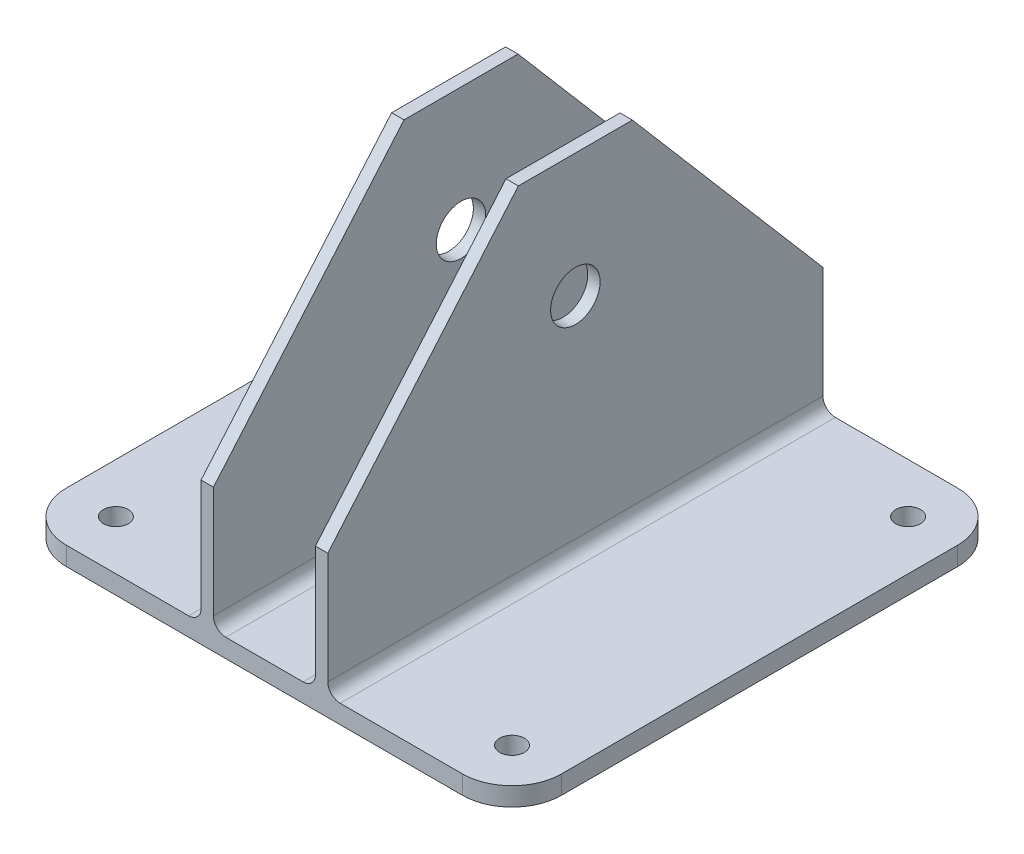
ISO-10303-21;
HEADER;
FILE_DESCRIPTION(('STEP AP214'),'2;1');
FILE_NAME('part.step','',(''),(''),'','','');
FILE_SCHEMA(('AUTOMOTIVE_DESIGN { 1 0 10303 214 1 1 1 1 }'));
ENDSEC;
DATA;
#1=APPLICATION_CONTEXT('core data for automotive mechanical design processes');
#2=APPLICATION_PROTOCOL_DEFINITION('international standard','automotive_design',2000,#1);
#3=PRODUCT_CONTEXT('',#1,'mechanical');
#4=PRODUCT('Part','Part','',(#3));
#5=PRODUCT_RELATED_PRODUCT_CATEGORY('part','',(#4));
#6=PRODUCT_DEFINITION_FORMATION('','',#4);
#7=PRODUCT_DEFINITION_CONTEXT('part definition',#1,'design');
#8=PRODUCT_DEFINITION('design','',#6,#7);
#9=PRODUCT_DEFINITION_SHAPE('','',#8);
#10=(LENGTH_UNIT() NAMED_UNIT(*) SI_UNIT(.MILLI.,.METRE.));
#11=(NAMED_UNIT(*) PLANE_ANGLE_UNIT() SI_UNIT($,.RADIAN.));
#12=(NAMED_UNIT(*) SI_UNIT($,.STERADIAN.) SOLID_ANGLE_UNIT());
#13=UNCERTAINTY_MEASURE_WITH_UNIT(LENGTH_MEASURE(1.E-05),#10,'distance_accuracy_value','');
#14=(GEOMETRIC_REPRESENTATION_CONTEXT(3) GLOBAL_UNCERTAINTY_ASSIGNED_CONTEXT((#13)) GLOBAL_UNIT_ASSIGNED_CONTEXT((#10,
#11,#12)) REPRESENTATION_CONTEXT('',''));
#15=CARTESIAN_POINT('',(0.,0.,0.));
#16=DIRECTION('',(0.,0.,1.));
#17=DIRECTION('',(1.,0.,0.));
#18=AXIS2_PLACEMENT_3D('',#15,#16,#17);
#19=CARTESIAN_POINT('',(-63.5,4.7625,-63.5));
#20=DIRECTION('',(0.,0.,1.));
#21=DIRECTION('',(1.,0.,0.));
#22=AXIS2_PLACEMENT_3D('',#19,#20,#21);
#23=PLANE('',#22);
#24=DIRECTION('',(-1.,0.,0.));
#25=VECTOR('',#24,1.);
#26=CARTESIAN_POINT('',(63.5,36.5125,-63.5));
#27=LINE('',#26,#25);
#28=CARTESIAN_POINT('',(16.256,36.5125,-63.5));
#29=VERTEX_POINT('',#28);
#30=CARTESIAN_POINT('',(13.081,36.5125,-63.5));
#31=VERTEX_POINT('',#30);
#32=EDGE_CURVE('E559',#29,#31,#27,.T.);
#33=ORIENTED_EDGE('',*,*,#32,.F.);
#34=DIRECTION('',(0.,-1.,0.));
#35=VECTOR('',#34,1.);
#36=CARTESIAN_POINT('',(16.256,93.6625,-63.5));
#37=LINE('',#36,#35);
#38=CARTESIAN_POINT('',(16.256,7.9375,-63.5));
#39=VERTEX_POINT('',#38);
#40=EDGE_CURVE('E224',#29,#39,#37,.T.);
#41=ORIENTED_EDGE('',*,*,#40,.T.);
#42=CARTESIAN_POINT('',(19.431,7.9375,-63.5));
#43=DIRECTION('',(0.,0.,1.));
#44=DIRECTION('',(1.,0.,0.));
#45=AXIS2_PLACEMENT_3D('',#42,#43,#44);
#46=CIRCLE('',#45,3.175);
#47=CARTESIAN_POINT('',(19.431,4.7625,-63.5));
#48=VERTEX_POINT('',#47);
#49=EDGE_CURVE('E309',#39,#48,#46,.T.);
#50=ORIENTED_EDGE('',*,*,#49,.T.);
#51=DIRECTION('',(-1.,0.,0.));
#52=VECTOR('',#51,1.);
#53=CARTESIAN_POINT('',(-63.5,4.7625,-63.5));
#54=LINE('',#53,#52);
#55=CARTESIAN_POINT('',(50.8,4.7625,-63.5));
#56=VERTEX_POINT('',#55);
#57=EDGE_CURVE('E256',#56,#48,#54,.T.);
#58=ORIENTED_EDGE('',*,*,#57,.F.);
#59=DIRECTION('',(0.,-1.,0.));
#60=VECTOR('',#59,1.);
#61=CARTESIAN_POINT('',(50.8,4.7625,-63.5));
#62=LINE('',#61,#60);
#63=CARTESIAN_POINT('',(50.8,0.,-63.5));
#64=VERTEX_POINT('',#63);
#65=EDGE_CURVE('E352',#56,#64,#62,.T.);
#66=ORIENTED_EDGE('',*,*,#65,.T.);
#67=DIRECTION('',(-1.,0.,0.));
#68=VECTOR('',#67,1.);
#69=CARTESIAN_POINT('',(-63.5,0.,-63.5));
#70=LINE('',#69,#68);
#71=CARTESIAN_POINT('',(-50.8,0.,-63.5));
#72=VERTEX_POINT('',#71);
#73=EDGE_CURVE('E246',#64,#72,#70,.T.);
#74=ORIENTED_EDGE('',*,*,#73,.T.);
#75=DIRECTION('',(0.,-1.,0.));
#76=VECTOR('',#75,1.);
#77=CARTESIAN_POINT('',(-50.8,4.7625,-63.5));
#78=LINE('',#77,#76);
#79=CARTESIAN_POINT('',(-50.8,4.7625,-63.5));
#80=VERTEX_POINT('',#79);
#81=EDGE_CURVE('E339',#72,#80,#78,.F.);
#82=ORIENTED_EDGE('',*,*,#81,.T.);
#83=CARTESIAN_POINT('',(-19.431,4.7625,-63.5));
#84=VERTEX_POINT('',#83);
#85=EDGE_CURVE('E255',#84,#80,#54,.T.);
#86=ORIENTED_EDGE('',*,*,#85,.F.);
#87=CARTESIAN_POINT('',(-19.431,7.9375,-63.5));
#88=DIRECTION('',(0.,0.,1.));
#89=DIRECTION('',(1.,0.,0.));
#90=AXIS2_PLACEMENT_3D('',#87,#88,#89);
#91=CIRCLE('',#90,3.175);
#92=CARTESIAN_POINT('',(-16.256,7.9375,-63.5));
#93=VERTEX_POINT('',#92);
#94=EDGE_CURVE('E335',#84,#93,#91,.T.);
#95=ORIENTED_EDGE('',*,*,#94,.T.);
#96=DIRECTION('',(0.,-1.,0.));
#97=VECTOR('',#96,1.);
#98=CARTESIAN_POINT('',(-16.256,93.6625,-63.5));
#99=LINE('',#98,#97);
#100=CARTESIAN_POINT('',(-16.256,36.5125,-63.5));
#101=VERTEX_POINT('',#100);
#102=EDGE_CURVE('E450',#101,#93,#99,.T.);
#103=ORIENTED_EDGE('',*,*,#102,.F.);
#104=CARTESIAN_POINT('',(-13.081,36.5125,-63.5));
#105=VERTEX_POINT('',#104);
#106=EDGE_CURVE('E215',#105,#101,#27,.T.);
#107=ORIENTED_EDGE('',*,*,#106,.F.);
#108=DIRECTION('',(0.,-1.,0.));
#109=VECTOR('',#108,1.);
#110=CARTESIAN_POINT('',(-13.081,93.6625,-63.5));
#111=LINE('',#110,#109);
#112=CARTESIAN_POINT('',(-13.081,7.9375,-63.5));
#113=VERTEX_POINT('',#112);
#114=EDGE_CURVE('E495',#105,#113,#111,.T.);
#115=ORIENTED_EDGE('',*,*,#114,.T.);
#116=CARTESIAN_POINT('',(-9.90599999999999,7.9375,-63.5));
#117=DIRECTION('',(0.,0.,1.));
#118=DIRECTION('',(1.,0.,0.));
#119=AXIS2_PLACEMENT_3D('',#116,#117,#118);
#120=CIRCLE('',#119,3.175);
#121=CARTESIAN_POINT('',(-9.90599999999998,4.7625,-63.5));
#122=VERTEX_POINT('',#121);
#123=EDGE_CURVE('E324',#113,#122,#120,.T.);
#124=ORIENTED_EDGE('',*,*,#123,.T.);
#125=CARTESIAN_POINT('',(9.90600000000001,4.7625,-63.5));
#126=VERTEX_POINT('',#125);
#127=EDGE_CURVE('E260',#126,#122,#54,.T.);
#128=ORIENTED_EDGE('',*,*,#127,.F.);
#129=CARTESIAN_POINT('',(9.90600000000001,7.9375,-63.5));
#130=DIRECTION('',(0.,0.,1.));
#131=DIRECTION('',(1.,0.,0.));
#132=AXIS2_PLACEMENT_3D('',#129,#130,#131);
#133=CIRCLE('',#132,3.175);
#134=CARTESIAN_POINT('',(13.081,7.9375,-63.5));
#135=VERTEX_POINT('',#134);
#136=EDGE_CURVE('E320',#126,#135,#133,.T.);
#137=ORIENTED_EDGE('',*,*,#136,.T.);
#138=DIRECTION('',(0.,-1.,0.));
#139=VECTOR('',#138,1.);
#140=CARTESIAN_POINT('',(13.081,93.6625,-63.5));
#141=LINE('',#140,#139);
#142=EDGE_CURVE('E232',#31,#135,#141,.T.);
#143=ORIENTED_EDGE('',*,*,#142,.F.);
#144=EDGE_LOOP('',(#33,#41,#50,#58,#66,#74,#82,#86,#95,#103,#107,#115,#124,#128,#137,#143));
#145=FACE_BOUND('',#144,.T.);
#146=ADVANCED_FACE('F47',(#145),#23,.F.);
#147=CARTESIAN_POINT('',(13.081,93.6625,-63.5));
#148=DIRECTION('',(1.,0.,0.));
#149=DIRECTION('',(0.,0.,-1.));
#150=AXIS2_PLACEMENT_3D('',#147,#148,#149);
#151=PLANE('',#150);
#152=CARTESIAN_POINT('',(13.081,61.9125,0.));
#153=DIRECTION('',(1.,0.,0.));
#154=DIRECTION('',(0.,0.,-1.));
#155=AXIS2_PLACEMENT_3D('',#152,#153,#154);
#156=CIRCLE('',#155,6.35000000000002);
#157=CARTESIAN_POINT('',(13.081,61.9125,-6.35000000000002));
#158=VERTEX_POINT('',#157);
#159=EDGE_CURVE('E488',#158,#158,#156,.T.);
#160=ORIENTED_EDGE('',*,*,#159,.T.);
#161=EDGE_LOOP('',(#160));
#162=FACE_BOUND('',#161,.T.);
#163=DIRECTION('',(0.,0.759979034971361,0.649947587428401));
#164=VECTOR('',#163,1.);
#165=CARTESIAN_POINT('',(13.081,69.5205188350114,-35.270955223238));
#166=LINE('',#165,#164);
#167=CARTESIAN_POINT('',(13.081,93.6625,-14.6243035501198));
#168=VERTEX_POINT('',#167);
#169=EDGE_CURVE('E71',#31,#168,#166,.T.);
#170=ORIENTED_EDGE('',*,*,#169,.F.);
#171=ORIENTED_EDGE('',*,*,#142,.T.);
#172=DIRECTION('',(0.,0.,1.));
#173=VECTOR('',#172,1.);
#174=CARTESIAN_POINT('',(13.081,7.9375,-63.5));
#175=LINE('',#174,#173);
#176=CARTESIAN_POINT('',(13.081,7.9375,63.5));
#177=VERTEX_POINT('',#176);
#178=EDGE_CURVE('E288',#135,#177,#175,.T.);
#179=ORIENTED_EDGE('',*,*,#178,.T.);
#180=DIRECTION('',(0.,-1.,0.));
#181=VECTOR('',#180,1.);
#182=CARTESIAN_POINT('',(13.081,93.6625,63.5));
#183=LINE('',#182,#181);
#184=CARTESIAN_POINT('',(13.081,36.5125,63.5));
#185=VERTEX_POINT('',#184);
#186=EDGE_CURVE('E484',#185,#177,#183,.T.);
#187=ORIENTED_EDGE('',*,*,#186,.F.);
#188=DIRECTION('',(0.,0.75997903497136,-0.649947587428402));
#189=VECTOR('',#188,1.);
#190=CARTESIAN_POINT('',(13.081,132.251729450038,-18.37789181007));
#191=LINE('',#190,#189);
#192=CARTESIAN_POINT('',(13.081,93.6625,14.6243035501197));
#193=VERTEX_POINT('',#192);
#194=EDGE_CURVE('E545',#185,#193,#191,.T.);
#195=ORIENTED_EDGE('',*,*,#194,.T.);
#196=DIRECTION('',(0.,0.,1.));
#197=VECTOR('',#196,1.);
#198=CARTESIAN_POINT('',(13.081,93.6625,-63.5));
#199=LINE('',#198,#197);
#200=EDGE_CURVE('E231',#168,#193,#199,.T.);
#201=ORIENTED_EDGE('',*,*,#200,.F.);
#202=EDGE_LOOP('',(#170,#171,#179,#187,#195,#201));
#203=FACE_BOUND('',#202,.T.);
#204=ADVANCED_FACE('F575',(#162,#203),#151,.F.);
#205=CARTESIAN_POINT('',(16.256,93.6625,-63.5));
#206=DIRECTION('',(-1.,0.,0.));
#207=DIRECTION('',(0.,0.,1.));
#208=AXIS2_PLACEMENT_3D('',#205,#206,#207);
#209=PLANE('',#208);
#210=CARTESIAN_POINT('',(16.256,61.9125,0.));
#211=DIRECTION('',(-1.,0.,0.));
#212=DIRECTION('',(0.,0.,1.));
#213=AXIS2_PLACEMENT_3D('',#210,#211,#212);
#214=CIRCLE('',#213,6.35000000000002);
#215=CARTESIAN_POINT('',(16.256,61.9125,6.35000000000002));
#216=VERTEX_POINT('',#215);
#217=EDGE_CURVE('E510',#216,#216,#214,.T.);
#218=ORIENTED_EDGE('',*,*,#217,.T.);
#219=EDGE_LOOP('',(#218));
#220=FACE_BOUND('',#219,.T.);
#221=DIRECTION('',(0.,-0.759979034971361,-0.649947587428401));
#222=VECTOR('',#221,1.);
#223=CARTESIAN_POINT('',(16.256,69.5205188350114,-35.270955223238));
#224=LINE('',#223,#222);
#225=CARTESIAN_POINT('',(16.256,93.6625,-14.6243035501198));
#226=VERTEX_POINT('',#225);
#227=EDGE_CURVE('E208',#226,#29,#224,.T.);
#228=ORIENTED_EDGE('',*,*,#227,.F.);
#229=DIRECTION('',(0.,0.,-1.));
#230=VECTOR('',#229,1.);
#231=CARTESIAN_POINT('',(16.256,93.6625,-63.5));
#232=LINE('',#231,#230);
#233=CARTESIAN_POINT('',(16.256,93.6625,14.6243035501198));
#234=VERTEX_POINT('',#233);
#235=EDGE_CURVE('E222',#234,#226,#232,.T.);
#236=ORIENTED_EDGE('',*,*,#235,.F.);
#237=DIRECTION('',(0.,-0.75997903497136,0.649947587428402));
#238=VECTOR('',#237,1.);
#239=CARTESIAN_POINT('',(16.256,132.251729450038,-18.37789181007));
#240=LINE('',#239,#238);
#241=CARTESIAN_POINT('',(16.256,36.5125,63.5));
#242=VERTEX_POINT('',#241);
#243=EDGE_CURVE('E63',#234,#242,#240,.T.);
#244=ORIENTED_EDGE('',*,*,#243,.T.);
#245=DIRECTION('',(0.,-1.,0.));
#246=VECTOR('',#245,1.);
#247=CARTESIAN_POINT('',(16.256,93.6625,63.5));
#248=LINE('',#247,#246);
#249=CARTESIAN_POINT('',(16.256,7.9375,63.5));
#250=VERTEX_POINT('',#249);
#251=EDGE_CURVE('E481',#242,#250,#248,.T.);
#252=ORIENTED_EDGE('',*,*,#251,.T.);
#253=DIRECTION('',(0.,0.,-1.));
#254=VECTOR('',#253,1.);
#255=CARTESIAN_POINT('',(16.256,7.9375,-63.5));
#256=LINE('',#255,#254);
#257=EDGE_CURVE('E259',#250,#39,#256,.T.);
#258=ORIENTED_EDGE('',*,*,#257,.T.);
#259=ORIENTED_EDGE('',*,*,#40,.F.);
#260=EDGE_LOOP('',(#228,#236,#244,#252,#258,#259));
#261=FACE_BOUND('',#260,.T.);
#262=ADVANCED_FACE('F221',(#220,#261),#209,.F.);
#263=CARTESIAN_POINT('',(0.,93.6625,0.));
#264=DIRECTION('',(0.,1.,0.));
#265=DIRECTION('',(0.,0.,1.));
#266=AXIS2_PLACEMENT_3D('',#263,#264,#265);
#267=PLANE('',#266);
#268=ORIENTED_EDGE('',*,*,#235,.T.);
#269=DIRECTION('',(-1.,0.,0.));
#270=VECTOR('',#269,1.);
#271=CARTESIAN_POINT('',(63.5,93.6625,-14.6243035501198));
#272=LINE('',#271,#270);
#273=EDGE_CURVE('E205',#226,#168,#272,.T.);
#274=ORIENTED_EDGE('',*,*,#273,.T.);
#275=ORIENTED_EDGE('',*,*,#200,.T.);
#276=DIRECTION('',(-1.,0.,0.));
#277=VECTOR('',#276,1.);
#278=CARTESIAN_POINT('',(63.5,93.6625,14.6243035501197));
#279=LINE('',#278,#277);
#280=EDGE_CURVE('E229',#234,#193,#279,.T.);
#281=ORIENTED_EDGE('',*,*,#280,.F.);
#282=EDGE_LOOP('',(#268,#274,#275,#281));
#283=FACE_BOUND('',#282,.T.);
#284=ADVANCED_FACE('F228',(#283),#267,.T.);
#285=CARTESIAN_POINT('',(-16.256,93.6625,-63.5));
#286=DIRECTION('',(1.,0.,0.));
#287=DIRECTION('',(0.,0.,-1.));
#288=AXIS2_PLACEMENT_3D('',#285,#286,#287);
#289=PLANE('',#288);
#290=CARTESIAN_POINT('',(-16.256,61.9125,0.));
#291=DIRECTION('',(1.,0.,0.));
#292=DIRECTION('',(0.,0.,-1.));
#293=AXIS2_PLACEMENT_3D('',#290,#291,#292);
#294=CIRCLE('',#293,6.35000000000002);
#295=CARTESIAN_POINT('',(-16.256,61.9125,-6.35000000000002));
#296=VERTEX_POINT('',#295);
#297=EDGE_CURVE('E281',#296,#296,#294,.T.);
#298=ORIENTED_EDGE('',*,*,#297,.T.);
#299=EDGE_LOOP('',(#298));
#300=FACE_BOUND('',#299,.T.);
#301=DIRECTION('',(0.,0.759979034971361,0.649947587428401));
#302=VECTOR('',#301,1.);
#303=CARTESIAN_POINT('',(-16.256,69.5205188350114,-35.270955223238));
#304=LINE('',#303,#302);
#305=CARTESIAN_POINT('',(-16.256,93.6625,-14.6243035501198));
#306=VERTEX_POINT('',#305);
#307=EDGE_CURVE('E226',#101,#306,#304,.T.);
#308=ORIENTED_EDGE('',*,*,#307,.F.);
#309=ORIENTED_EDGE('',*,*,#102,.T.);
#310=DIRECTION('',(0.,0.,1.));
#311=VECTOR('',#310,1.);
#312=CARTESIAN_POINT('',(-16.256,7.9375,-63.5));
#313=LINE('',#312,#311);
#314=CARTESIAN_POINT('',(-16.256,7.9375,63.5));
#315=VERTEX_POINT('',#314);
#316=EDGE_CURVE('E302',#93,#315,#313,.T.);
#317=ORIENTED_EDGE('',*,*,#316,.T.);
#318=DIRECTION('',(0.,-1.,0.));
#319=VECTOR('',#318,1.);
#320=CARTESIAN_POINT('',(-16.256,93.6625,63.5));
#321=LINE('',#320,#319);
#322=CARTESIAN_POINT('',(-16.256,36.5125,63.5));
#323=VERTEX_POINT('',#322);
#324=EDGE_CURVE('E266',#323,#315,#321,.T.);
#325=ORIENTED_EDGE('',*,*,#324,.F.);
#326=DIRECTION('',(0.,0.75997903497136,-0.649947587428402));
#327=VECTOR('',#326,1.);
#328=CARTESIAN_POINT('',(-16.256,132.251729450038,-18.37789181007));
#329=LINE('',#328,#327);
#330=CARTESIAN_POINT('',(-16.256,93.6625,14.6243035501197));
#331=VERTEX_POINT('',#330);
#332=EDGE_CURVE('E551',#323,#331,#329,.T.);
#333=ORIENTED_EDGE('',*,*,#332,.T.);
#334=DIRECTION('',(0.,0.,1.));
#335=VECTOR('',#334,1.);
#336=CARTESIAN_POINT('',(-16.256,93.6625,-63.5));
#337=LINE('',#336,#335);
#338=EDGE_CURVE('E236',#306,#331,#337,.T.);
#339=ORIENTED_EDGE('',*,*,#338,.F.);
#340=EDGE_LOOP('',(#308,#309,#317,#325,#333,#339));
#341=FACE_BOUND('',#340,.T.);
#342=ADVANCED_FACE('F656',(#300,#341),#289,.F.);
#343=CARTESIAN_POINT('',(-13.081,93.6625,-63.5));
#344=DIRECTION('',(-1.,0.,0.));
#345=DIRECTION('',(0.,0.,1.));
#346=AXIS2_PLACEMENT_3D('',#343,#344,#345);
#347=PLANE('',#346);
#348=CARTESIAN_POINT('',(-13.081,61.9125,0.));
#349=DIRECTION('',(-1.,0.,0.));
#350=DIRECTION('',(0.,0.,1.));
#351=AXIS2_PLACEMENT_3D('',#348,#349,#350);
#352=CIRCLE('',#351,6.35000000000002);
#353=CARTESIAN_POINT('',(-13.081,61.9125,6.35000000000003));
#354=VERTEX_POINT('',#353);
#355=EDGE_CURVE('E277',#354,#354,#352,.T.);
#356=ORIENTED_EDGE('',*,*,#355,.T.);
#357=EDGE_LOOP('',(#356));
#358=FACE_BOUND('',#357,.T.);
#359=DIRECTION('',(0.,-0.759979034971361,-0.649947587428401));
#360=VECTOR('',#359,1.);
#361=CARTESIAN_POINT('',(-13.081,69.5205188350114,-35.270955223238));
#362=LINE('',#361,#360);
#363=CARTESIAN_POINT('',(-13.081,93.6625,-14.6243035501198));
#364=VERTEX_POINT('',#363);
#365=EDGE_CURVE('E542',#364,#105,#362,.T.);
#366=ORIENTED_EDGE('',*,*,#365,.F.);
#367=DIRECTION('',(0.,0.,-1.));
#368=VECTOR('',#367,1.);
#369=CARTESIAN_POINT('',(-13.081,93.6625,-63.5));
#370=LINE('',#369,#368);
#371=CARTESIAN_POINT('',(-13.081,93.6625,14.6243035501198));
#372=VERTEX_POINT('',#371);
#373=EDGE_CURVE('E500',#372,#364,#370,.T.);
#374=ORIENTED_EDGE('',*,*,#373,.F.);
#375=DIRECTION('',(0.,-0.75997903497136,0.649947587428402));
#376=VECTOR('',#375,1.);
#377=CARTESIAN_POINT('',(-13.081,132.251729450038,-18.37789181007));
#378=LINE('',#377,#376);
#379=CARTESIAN_POINT('',(-13.081,36.5125,63.5));
#380=VERTEX_POINT('',#379);
#381=EDGE_CURVE('E555',#372,#380,#378,.T.);
#382=ORIENTED_EDGE('',*,*,#381,.T.);
#383=DIRECTION('',(0.,-1.,0.));
#384=VECTOR('',#383,1.);
#385=CARTESIAN_POINT('',(-13.081,93.6625,63.5));
#386=LINE('',#385,#384);
#387=CARTESIAN_POINT('',(-13.081,7.9375,63.5));
#388=VERTEX_POINT('',#387);
#389=EDGE_CURVE('E468',#380,#388,#386,.T.);
#390=ORIENTED_EDGE('',*,*,#389,.T.);
#391=DIRECTION('',(0.,0.,-1.));
#392=VECTOR('',#391,1.);
#393=CARTESIAN_POINT('',(-13.081,7.9375,-63.5));
#394=LINE('',#393,#392);
#395=EDGE_CURVE('E298',#388,#113,#394,.T.);
#396=ORIENTED_EDGE('',*,*,#395,.T.);
#397=ORIENTED_EDGE('',*,*,#114,.F.);
#398=EDGE_LOOP('',(#366,#374,#382,#390,#396,#397));
#399=FACE_BOUND('',#398,.T.);
#400=ADVANCED_FACE('F647',(#358,#399),#347,.F.);
#401=CARTESIAN_POINT('',(0.,93.6625,0.));
#402=DIRECTION('',(0.,1.,0.));
#403=DIRECTION('',(0.,0.,1.));
#404=AXIS2_PLACEMENT_3D('',#401,#402,#403);
#405=PLANE('',#404);
#406=ORIENTED_EDGE('',*,*,#373,.T.);
#407=EDGE_CURVE('E216',#364,#306,#272,.T.);
#408=ORIENTED_EDGE('',*,*,#407,.T.);
#409=ORIENTED_EDGE('',*,*,#338,.T.);
#410=EDGE_CURVE('E560',#372,#331,#279,.T.);
#411=ORIENTED_EDGE('',*,*,#410,.F.);
#412=EDGE_LOOP('',(#406,#408,#409,#411));
#413=FACE_BOUND('',#412,.T.);
#414=ADVANCED_FACE('F642',(#413),#405,.T.);
#415=CARTESIAN_POINT('',(0.,0.,0.));
#416=DIRECTION('',(0.,1.,0.));
#417=DIRECTION('',(0.,0.,1.));
#418=AXIS2_PLACEMENT_3D('',#415,#416,#417);
#419=PLANE('',#418);
#420=CARTESIAN_POINT('',(-50.8000000000002,0.,50.8));
#421=DIRECTION('',(0.,1.,0.));
#422=DIRECTION('',(0.,0.,1.));
#423=AXIS2_PLACEMENT_3D('',#420,#421,#422);
#424=CIRCLE('',#423,3.175);
#425=CARTESIAN_POINT('',(-50.8000000000002,0.,53.975));
#426=VERTEX_POINT('',#425);
#427=EDGE_CURVE('E524',#426,#426,#424,.F.);
#428=ORIENTED_EDGE('',*,*,#427,.F.);
#429=EDGE_LOOP('',(#428));
#430=FACE_BOUND('',#429,.T.);
#431=ORIENTED_EDGE('',*,*,#73,.F.);
#432=CARTESIAN_POINT('',(50.8,0.,-50.8));
#433=DIRECTION('',(0.,1.,0.));
#434=DIRECTION('',(0.,0.,1.));
#435=AXIS2_PLACEMENT_3D('',#432,#433,#434);
#436=CIRCLE('',#435,12.7);
#437=CARTESIAN_POINT('',(63.5,0.,-50.8));
#438=VERTEX_POINT('',#437);
#439=EDGE_CURVE('E365',#64,#438,#436,.F.);
#440=ORIENTED_EDGE('',*,*,#439,.T.);
#441=DIRECTION('',(0.,0.,-1.));
#442=VECTOR('',#441,1.);
#443=CARTESIAN_POINT('',(63.5,0.,-63.5));
#444=LINE('',#443,#442);
#445=CARTESIAN_POINT('',(63.5,0.,50.8));
#446=VERTEX_POINT('',#445);
#447=EDGE_CURVE('E270',#446,#438,#444,.T.);
#448=ORIENTED_EDGE('',*,*,#447,.F.);
#449=CARTESIAN_POINT('',(50.8,0.,50.8));
#450=DIRECTION('',(0.,1.,0.));
#451=DIRECTION('',(0.,0.,1.));
#452=AXIS2_PLACEMENT_3D('',#449,#450,#451);
#453=CIRCLE('',#452,12.7);
#454=CARTESIAN_POINT('',(50.8,0.,63.5));
#455=VERTEX_POINT('',#454);
#456=EDGE_CURVE('E362',#446,#455,#453,.F.);
#457=ORIENTED_EDGE('',*,*,#456,.T.);
#458=DIRECTION('',(1.,0.,0.));
#459=VECTOR('',#458,1.);
#460=CARTESIAN_POINT('',(-63.5,0.,63.5));
#461=LINE('',#460,#459);
#462=CARTESIAN_POINT('',(-50.8,0.,63.5));
#463=VERTEX_POINT('',#462);
#464=EDGE_CURVE('E265',#463,#455,#461,.T.);
#465=ORIENTED_EDGE('',*,*,#464,.F.);
#466=CARTESIAN_POINT('',(-50.8,0.,50.8));
#467=DIRECTION('',(0.,1.,0.));
#468=DIRECTION('',(0.,0.,1.));
#469=AXIS2_PLACEMENT_3D('',#466,#467,#468);
#470=CIRCLE('',#469,12.7);
#471=CARTESIAN_POINT('',(-63.5,0.,50.8));
#472=VERTEX_POINT('',#471);
#473=EDGE_CURVE('E359',#463,#472,#470,.F.);
#474=ORIENTED_EDGE('',*,*,#473,.T.);
#475=DIRECTION('',(0.,0.,1.));
#476=VECTOR('',#475,1.);
#477=CARTESIAN_POINT('',(-63.5,0.,-63.5));
#478=LINE('',#477,#476);
#479=CARTESIAN_POINT('',(-63.5,0.,-50.8));
#480=VERTEX_POINT('',#479);
#481=EDGE_CURVE('E261',#480,#472,#478,.T.);
#482=ORIENTED_EDGE('',*,*,#481,.F.);
#483=CARTESIAN_POINT('',(-50.8,0.,-50.8));
#484=DIRECTION('',(0.,1.,0.));
#485=DIRECTION('',(0.,0.,1.));
#486=AXIS2_PLACEMENT_3D('',#483,#484,#485);
#487=CIRCLE('',#486,12.7);
#488=EDGE_CURVE('E356',#480,#72,#487,.F.);
#489=ORIENTED_EDGE('',*,*,#488,.T.);
#490=EDGE_LOOP('',(#431,#440,#448,#457,#465,#474,#482,#489));
#491=FACE_BOUND('',#490,.T.);
#492=CARTESIAN_POINT('',(-50.8000000000012,0.,-50.8));
#493=DIRECTION('',(0.,1.,0.));
#494=DIRECTION('',(0.,0.,1.));
#495=AXIS2_PLACEMENT_3D('',#492,#493,#494);
#496=CIRCLE('',#495,3.175);
#497=CARTESIAN_POINT('',(-50.8000000000012,0.,-47.625));
#498=VERTEX_POINT('',#497);
#499=EDGE_CURVE('E349',#498,#498,#496,.T.);
#500=ORIENTED_EDGE('',*,*,#499,.T.);
#501=EDGE_LOOP('',(#500));
#502=FACE_BOUND('',#501,.T.);
#503=CARTESIAN_POINT('',(50.8000000000012,0.,-50.8));
#504=DIRECTION('',(0.,-1.,0.));
#505=DIRECTION('',(0.,0.,1.));
#506=AXIS2_PLACEMENT_3D('',#503,#504,#505);
#507=CIRCLE('',#506,3.175);
#508=CARTESIAN_POINT('',(50.8000000000012,0.,-47.625));
#509=VERTEX_POINT('',#508);
#510=EDGE_CURVE('E531',#509,#509,#507,.T.);
#511=ORIENTED_EDGE('',*,*,#510,.F.);
#512=EDGE_LOOP('',(#511));
#513=FACE_BOUND('',#512,.T.);
#514=CARTESIAN_POINT('',(50.8000000000002,0.,50.8));
#515=DIRECTION('',(0.,-1.,0.));
#516=DIRECTION('',(0.,0.,1.));
#517=AXIS2_PLACEMENT_3D('',#514,#515,#516);
#518=CIRCLE('',#517,3.175);
#519=CARTESIAN_POINT('',(50.8000000000002,0.,53.975));
#520=VERTEX_POINT('',#519);
#521=EDGE_CURVE('E345',#520,#520,#518,.F.);
#522=ORIENTED_EDGE('',*,*,#521,.T.);
#523=EDGE_LOOP('',(#522));
#524=FACE_BOUND('',#523,.T.);
#525=ADVANCED_FACE('F412',(#430,#491,#502,#513,#524),#419,.F.);
#526=CARTESIAN_POINT('',(0.,4.7625,0.));
#527=DIRECTION('',(0.,1.,0.));
#528=DIRECTION('',(0.,0.,1.));
#529=AXIS2_PLACEMENT_3D('',#526,#527,#528);
#530=PLANE('',#529);
#531=CARTESIAN_POINT('',(50.8000000000012,4.7625,-50.8));
#532=DIRECTION('',(0.,1.,0.));
#533=DIRECTION('',(0.,0.,1.));
#534=AXIS2_PLACEMENT_3D('',#531,#532,#533);
#535=CIRCLE('',#534,3.175);
#536=CARTESIAN_POINT('',(50.8000000000012,4.7625,-47.625));
#537=VERTEX_POINT('',#536);
#538=EDGE_CURVE('E340',#537,#537,#535,.F.);
#539=ORIENTED_EDGE('',*,*,#538,.T.);
#540=EDGE_LOOP('',(#539));
#541=FACE_BOUND('',#540,.T.);
#542=DIRECTION('',(0.,0.,-1.));
#543=VECTOR('',#542,1.);
#544=CARTESIAN_POINT('',(63.5,4.7625,-63.5));
#545=LINE('',#544,#543);
#546=CARTESIAN_POINT('',(63.5,4.7625,50.8));
#547=VERTEX_POINT('',#546);
#548=CARTESIAN_POINT('',(63.5,4.7625,-50.8));
#549=VERTEX_POINT('',#548);
#550=EDGE_CURVE('E250',#547,#549,#545,.T.);
#551=ORIENTED_EDGE('',*,*,#550,.T.);
#552=CARTESIAN_POINT('',(50.8,4.7625,-50.8));
#553=DIRECTION('',(0.,1.,0.));
#554=DIRECTION('',(0.,0.,1.));
#555=AXIS2_PLACEMENT_3D('',#552,#553,#554);
#556=CIRCLE('',#555,12.7);
#557=EDGE_CURVE('E378',#549,#56,#556,.T.);
#558=ORIENTED_EDGE('',*,*,#557,.T.);
#559=ORIENTED_EDGE('',*,*,#57,.T.);
#560=DIRECTION('',(0.,0.,-1.));
#561=VECTOR('',#560,1.);
#562=CARTESIAN_POINT('',(19.431,4.7625,0.));
#563=LINE('',#562,#561);
#564=CARTESIAN_POINT('',(19.431,4.7625,63.5));
#565=VERTEX_POINT('',#564);
#566=EDGE_CURVE('E285',#48,#565,#563,.F.);
#567=ORIENTED_EDGE('',*,*,#566,.T.);
#568=DIRECTION('',(1.,0.,0.));
#569=VECTOR('',#568,1.);
#570=CARTESIAN_POINT('',(-63.5,4.7625,63.5));
#571=LINE('',#570,#569);
#572=CARTESIAN_POINT('',(50.8,4.7625,63.5));
#573=VERTEX_POINT('',#572);
#574=EDGE_CURVE('E245',#565,#573,#571,.T.);
#575=ORIENTED_EDGE('',*,*,#574,.T.);
#576=CARTESIAN_POINT('',(50.8,4.7625,50.8));
#577=DIRECTION('',(0.,1.,0.));
#578=DIRECTION('',(0.,0.,1.));
#579=AXIS2_PLACEMENT_3D('',#576,#577,#578);
#580=CIRCLE('',#579,12.7);
#581=EDGE_CURVE('E375',#573,#547,#580,.T.);
#582=ORIENTED_EDGE('',*,*,#581,.T.);
#583=EDGE_LOOP('',(#551,#558,#559,#567,#575,#582));
#584=FACE_BOUND('',#583,.T.);
#585=CARTESIAN_POINT('',(50.8000000000002,4.7625,50.8));
#586=DIRECTION('',(0.,1.,0.));
#587=DIRECTION('',(0.,0.,1.));
#588=AXIS2_PLACEMENT_3D('',#585,#586,#587);
#589=CIRCLE('',#588,3.175);
#590=CARTESIAN_POINT('',(50.8000000000002,4.7625,53.975));
#591=VERTEX_POINT('',#590);
#592=EDGE_CURVE('E344',#591,#591,#589,.T.);
#593=ORIENTED_EDGE('',*,*,#592,.F.);
#594=EDGE_LOOP('',(#593));
#595=FACE_BOUND('',#594,.T.);
#596=ADVANCED_FACE('F473',(#541,#584,#595),#530,.T.);
#597=DIRECTION('',(0.,0.,1.));
#598=VECTOR('',#597,1.);
#599=CARTESIAN_POINT('',(-63.5,4.7625,-63.5));
#600=LINE('',#599,#598);
#601=CARTESIAN_POINT('',(-63.5,4.7625,-50.8));
#602=VERTEX_POINT('',#601);
#603=CARTESIAN_POINT('',(-63.5,4.7625,50.8));
#604=VERTEX_POINT('',#603);
#605=EDGE_CURVE('E241',#602,#604,#600,.T.);
#606=ORIENTED_EDGE('',*,*,#605,.T.);
#607=CARTESIAN_POINT('',(-50.8,4.7625,50.8));
#608=DIRECTION('',(0.,1.,0.));
#609=DIRECTION('',(0.,0.,1.));
#610=AXIS2_PLACEMENT_3D('',#607,#608,#609);
#611=CIRCLE('',#610,12.7);
#612=CARTESIAN_POINT('',(-50.8,4.7625,63.5));
#613=VERTEX_POINT('',#612);
#614=EDGE_CURVE('E11',#604,#613,#611,.T.);
#615=ORIENTED_EDGE('',*,*,#614,.T.);
#616=CARTESIAN_POINT('',(-19.431,4.7625,63.5));
#617=VERTEX_POINT('',#616);
#618=EDGE_CURVE('E247',#613,#617,#571,.T.);
#619=ORIENTED_EDGE('',*,*,#618,.T.);
#620=DIRECTION('',(0.,0.,1.));
#621=VECTOR('',#620,1.);
#622=CARTESIAN_POINT('',(-19.431,4.7625,0.));
#623=LINE('',#622,#621);
#624=EDGE_CURVE('E306',#617,#84,#623,.F.);
#625=ORIENTED_EDGE('',*,*,#624,.T.);
#626=ORIENTED_EDGE('',*,*,#85,.T.);
#627=CARTESIAN_POINT('',(-50.8,4.7625,-50.8));
#628=DIRECTION('',(0.,1.,0.));
#629=DIRECTION('',(0.,0.,1.));
#630=AXIS2_PLACEMENT_3D('',#627,#628,#629);
#631=CIRCLE('',#630,12.7);
#632=EDGE_CURVE('E56',#80,#602,#631,.T.);
#633=ORIENTED_EDGE('',*,*,#632,.T.);
#634=EDGE_LOOP('',(#606,#615,#619,#625,#626,#633));
#635=FACE_BOUND('',#634,.T.);
#636=CARTESIAN_POINT('',(-50.8000000000012,4.7625,-50.8));
#637=DIRECTION('',(0.,1.,0.));
#638=DIRECTION('',(0.,0.,1.));
#639=AXIS2_PLACEMENT_3D('',#636,#637,#638);
#640=CIRCLE('',#639,3.175);
#641=CARTESIAN_POINT('',(-50.8000000000012,4.7625,-47.625));
#642=VERTEX_POINT('',#641);
#643=EDGE_CURVE('E520',#642,#642,#640,.T.);
#644=ORIENTED_EDGE('',*,*,#643,.F.);
#645=EDGE_LOOP('',(#644));
#646=FACE_BOUND('',#645,.T.);
#647=CARTESIAN_POINT('',(-50.8000000000002,4.7625,50.8));
#648=DIRECTION('',(0.,1.,0.));
#649=DIRECTION('',(0.,0.,1.));
#650=AXIS2_PLACEMENT_3D('',#647,#648,#649);
#651=CIRCLE('',#650,3.175);
#652=CARTESIAN_POINT('',(-50.8000000000002,4.7625,53.975));
#653=VERTEX_POINT('',#652);
#654=EDGE_CURVE('E282',#653,#653,#651,.F.);
#655=ORIENTED_EDGE('',*,*,#654,.T.);
#656=EDGE_LOOP('',(#655));
#657=FACE_BOUND('',#656,.T.);
#658=ADVANCED_FACE('F399',(#635,#646,#657),#530,.T.);
#659=CARTESIAN_POINT('',(-9.90599999999997,4.7625,63.5));
#660=VERTEX_POINT('',#659);
#661=CARTESIAN_POINT('',(9.90600000000003,4.7625,63.5));
#662=VERTEX_POINT('',#661);
#663=EDGE_CURVE('E251',#660,#662,#571,.T.);
#664=ORIENTED_EDGE('',*,*,#663,.T.);
#665=DIRECTION('',(0.,0.,1.));
#666=VECTOR('',#665,1.);
#667=CARTESIAN_POINT('',(9.90600000000002,4.7625,0.));
#668=LINE('',#667,#666);
#669=EDGE_CURVE('E295',#662,#126,#668,.F.);
#670=ORIENTED_EDGE('',*,*,#669,.T.);
#671=ORIENTED_EDGE('',*,*,#127,.T.);
#672=DIRECTION('',(0.,0.,-1.));
#673=VECTOR('',#672,1.);
#674=CARTESIAN_POINT('',(-9.90599999999998,4.7625,0.));
#675=LINE('',#674,#673);
#676=EDGE_CURVE('E292',#122,#660,#675,.F.);
#677=ORIENTED_EDGE('',*,*,#676,.T.);
#678=EDGE_LOOP('',(#664,#670,#671,#677));
#679=FACE_BOUND('',#678,.T.);
#680=ADVANCED_FACE('F458',(#679),#530,.T.);
#681=CARTESIAN_POINT('',(-63.5,4.7625,-63.5));
#682=DIRECTION('',(1.,0.,0.));
#683=DIRECTION('',(0.,0.,-1.));
#684=AXIS2_PLACEMENT_3D('',#681,#682,#683);
#685=PLANE('',#684);
#686=ORIENTED_EDGE('',*,*,#481,.T.);
#687=DIRECTION('',(0.,-1.,0.));
#688=VECTOR('',#687,1.);
#689=CARTESIAN_POINT('',(-63.5,4.7625,50.8));
#690=LINE('',#689,#688);
#691=EDGE_CURVE('E392',#472,#604,#690,.F.);
#692=ORIENTED_EDGE('',*,*,#691,.T.);
#693=ORIENTED_EDGE('',*,*,#605,.F.);
#694=DIRECTION('',(0.,-1.,0.));
#695=VECTOR('',#694,1.);
#696=CARTESIAN_POINT('',(-63.5,4.7625,-50.8));
#697=LINE('',#696,#695);
#698=EDGE_CURVE('E388',#602,#480,#697,.T.);
#699=ORIENTED_EDGE('',*,*,#698,.T.);
#700=EDGE_LOOP('',(#686,#692,#693,#699));
#701=FACE_BOUND('',#700,.T.);
#702=ADVANCED_FACE('F407',(#701),#685,.F.);
#703=CARTESIAN_POINT('',(-63.5,4.7625,63.5));
#704=DIRECTION('',(0.,0.,-1.));
#705=DIRECTION('',(-1.,0.,0.));
#706=AXIS2_PLACEMENT_3D('',#703,#704,#705);
#707=PLANE('',#706);
#708=ORIENTED_EDGE('',*,*,#251,.F.);
#709=DIRECTION('',(-1.,0.,0.));
#710=VECTOR('',#709,1.);
#711=CARTESIAN_POINT('',(63.5,36.5125,63.5));
#712=LINE('',#711,#710);
#713=EDGE_CURVE('E565',#242,#185,#712,.T.);
#714=ORIENTED_EDGE('',*,*,#713,.T.);
#715=ORIENTED_EDGE('',*,*,#186,.T.);
#716=CARTESIAN_POINT('',(9.90600000000003,7.9375,63.5));
#717=DIRECTION('',(0.,0.,-1.));
#718=DIRECTION('',(-1.,0.,0.));
#719=AXIS2_PLACEMENT_3D('',#716,#717,#718);
#720=CIRCLE('',#719,3.175);
#721=EDGE_CURVE('E317',#177,#662,#720,.T.);
#722=ORIENTED_EDGE('',*,*,#721,.T.);
#723=ORIENTED_EDGE('',*,*,#663,.F.);
#724=CARTESIAN_POINT('',(-9.90599999999997,7.9375,63.5));
#725=DIRECTION('',(0.,0.,-1.));
#726=DIRECTION('',(-1.,0.,0.));
#727=AXIS2_PLACEMENT_3D('',#724,#725,#726);
#728=CIRCLE('',#727,3.175);
#729=EDGE_CURVE('E327',#660,#388,#728,.T.);
#730=ORIENTED_EDGE('',*,*,#729,.T.);
#731=ORIENTED_EDGE('',*,*,#389,.F.);
#732=EDGE_CURVE('E563',#380,#323,#712,.T.);
#733=ORIENTED_EDGE('',*,*,#732,.T.);
#734=ORIENTED_EDGE('',*,*,#324,.T.);
#735=CARTESIAN_POINT('',(-19.431,7.9375,63.5));
#736=DIRECTION('',(0.,0.,-1.));
#737=DIRECTION('',(-1.,0.,0.));
#738=AXIS2_PLACEMENT_3D('',#735,#736,#737);
#739=CIRCLE('',#738,3.175);
#740=EDGE_CURVE('E331',#315,#617,#739,.T.);
#741=ORIENTED_EDGE('',*,*,#740,.T.);
#742=ORIENTED_EDGE('',*,*,#618,.F.);
#743=DIRECTION('',(0.,-1.,0.));
#744=VECTOR('',#743,1.);
#745=CARTESIAN_POINT('',(-50.8,4.7625,63.5));
#746=LINE('',#745,#744);
#747=EDGE_CURVE('E381',#613,#463,#746,.T.);
#748=ORIENTED_EDGE('',*,*,#747,.T.);
#749=ORIENTED_EDGE('',*,*,#464,.T.);
#750=DIRECTION('',(0.,-1.,0.));
#751=VECTOR('',#750,1.);
#752=CARTESIAN_POINT('',(50.8,4.7625,63.5));
#753=LINE('',#752,#751);
#754=EDGE_CURVE('E385',#455,#573,#753,.F.);
#755=ORIENTED_EDGE('',*,*,#754,.T.);
#756=ORIENTED_EDGE('',*,*,#574,.F.);
#757=CARTESIAN_POINT('',(19.431,7.9375,63.5));
#758=DIRECTION('',(0.,0.,-1.));
#759=DIRECTION('',(-1.,0.,0.));
#760=AXIS2_PLACEMENT_3D('',#757,#758,#759);
#761=CIRCLE('',#760,3.175);
#762=EDGE_CURVE('E313',#565,#250,#761,.T.);
#763=ORIENTED_EDGE('',*,*,#762,.T.);
#764=EDGE_LOOP('',(#708,#714,#715,#722,#723,#730,#731,#733,#734,#741,#742,#748,#749,#755,#756,#763));
#765=FACE_BOUND('',#764,.T.);
#766=ADVANCED_FACE('F433',(#765),#707,.F.);
#767=CARTESIAN_POINT('',(63.5,4.7625,-63.5));
#768=DIRECTION('',(-1.,0.,0.));
#769=DIRECTION('',(0.,0.,1.));
#770=AXIS2_PLACEMENT_3D('',#767,#768,#769);
#771=PLANE('',#770);
#772=ORIENTED_EDGE('',*,*,#447,.T.);
#773=DIRECTION('',(0.,-1.,0.));
#774=VECTOR('',#773,1.);
#775=CARTESIAN_POINT('',(63.5,4.7625,-50.8));
#776=LINE('',#775,#774);
#777=EDGE_CURVE('E372',#438,#549,#776,.F.);
#778=ORIENTED_EDGE('',*,*,#777,.T.);
#779=ORIENTED_EDGE('',*,*,#550,.F.);
#780=DIRECTION('',(0.,-1.,0.));
#781=VECTOR('',#780,1.);
#782=CARTESIAN_POINT('',(63.5,4.7625,50.8));
#783=LINE('',#782,#781);
#784=EDGE_CURVE('E368',#547,#446,#783,.T.);
#785=ORIENTED_EDGE('',*,*,#784,.T.);
#786=EDGE_LOOP('',(#772,#778,#779,#785));
#787=FACE_BOUND('',#786,.T.);
#788=ADVANCED_FACE('F423',(#787),#771,.F.);
#789=CARTESIAN_POINT('',(63.5,61.9125,0.));
#790=DIRECTION('',(-1.,0.,0.));
#791=DIRECTION('',(0.,0.,1.));
#792=AXIS2_PLACEMENT_3D('',#789,#790,#791);
#793=CYLINDRICAL_SURFACE('',#792,6.35000000000002);
#794=ORIENTED_EDGE('',*,*,#355,.F.);
#795=EDGE_LOOP('',(#794));
#796=FACE_BOUND('',#795,.T.);
#797=ORIENTED_EDGE('',*,*,#297,.F.);
#798=EDGE_LOOP('',(#797));
#799=FACE_BOUND('',#798,.T.);
#800=ADVANCED_FACE('F608',(#796,#799),#793,.F.);
#801=ORIENTED_EDGE('',*,*,#217,.F.);
#802=EDGE_LOOP('',(#801));
#803=FACE_BOUND('',#802,.T.);
#804=ORIENTED_EDGE('',*,*,#159,.F.);
#805=EDGE_LOOP('',(#804));
#806=FACE_BOUND('',#805,.T.);
#807=ADVANCED_FACE('F615',(#803,#806),#793,.F.);
#808=CARTESIAN_POINT('',(19.431,7.9375,-63.5));
#809=DIRECTION('',(0.,0.,-1.));
#810=DIRECTION('',(-1.,0.,0.));
#811=AXIS2_PLACEMENT_3D('',#808,#809,#810);
#812=CYLINDRICAL_SURFACE('',#811,3.175);
#813=ORIENTED_EDGE('',*,*,#762,.F.);
#814=ORIENTED_EDGE('',*,*,#566,.F.);
#815=ORIENTED_EDGE('',*,*,#49,.F.);
#816=ORIENTED_EDGE('',*,*,#257,.F.);
#817=EDGE_LOOP('',(#813,#814,#815,#816));
#818=FACE_BOUND('',#817,.T.);
#819=ADVANCED_FACE('F479',(#818),#812,.F.);
#820=CARTESIAN_POINT('',(9.90600000000001,7.9375,-63.5));
#821=DIRECTION('',(0.,0.,1.));
#822=DIRECTION('',(1.,0.,0.));
#823=AXIS2_PLACEMENT_3D('',#820,#821,#822);
#824=CYLINDRICAL_SURFACE('',#823,3.175);
#825=ORIENTED_EDGE('',*,*,#136,.F.);
#826=ORIENTED_EDGE('',*,*,#669,.F.);
#827=ORIENTED_EDGE('',*,*,#721,.F.);
#828=ORIENTED_EDGE('',*,*,#178,.F.);
#829=EDGE_LOOP('',(#825,#826,#827,#828));
#830=FACE_BOUND('',#829,.T.);
#831=ADVANCED_FACE('F578',(#830),#824,.F.);
#832=CARTESIAN_POINT('',(-9.90599999999999,7.9375,-63.5));
#833=DIRECTION('',(0.,0.,-1.));
#834=DIRECTION('',(-1.,0.,0.));
#835=AXIS2_PLACEMENT_3D('',#832,#833,#834);
#836=CYLINDRICAL_SURFACE('',#835,3.175);
#837=ORIENTED_EDGE('',*,*,#729,.F.);
#838=ORIENTED_EDGE('',*,*,#676,.F.);
#839=ORIENTED_EDGE('',*,*,#123,.F.);
#840=ORIENTED_EDGE('',*,*,#395,.F.);
#841=EDGE_LOOP('',(#837,#838,#839,#840));
#842=FACE_BOUND('',#841,.T.);
#843=ADVANCED_FACE('F465',(#842),#836,.F.);
#844=CARTESIAN_POINT('',(-19.431,7.9375,-63.5));
#845=DIRECTION('',(0.,0.,1.));
#846=DIRECTION('',(1.,0.,0.));
#847=AXIS2_PLACEMENT_3D('',#844,#845,#846);
#848=CYLINDRICAL_SURFACE('',#847,3.175);
#849=ORIENTED_EDGE('',*,*,#94,.F.);
#850=ORIENTED_EDGE('',*,*,#624,.F.);
#851=ORIENTED_EDGE('',*,*,#740,.F.);
#852=ORIENTED_EDGE('',*,*,#316,.F.);
#853=EDGE_LOOP('',(#849,#850,#851,#852));
#854=FACE_BOUND('',#853,.T.);
#855=ADVANCED_FACE('F447',(#854),#848,.F.);
#856=CARTESIAN_POINT('',(-50.8000000000012,0.,-50.8));
#857=DIRECTION('',(0.,1.,0.));
#858=DIRECTION('',(0.,0.,1.));
#859=AXIS2_PLACEMENT_3D('',#856,#857,#858);
#860=CYLINDRICAL_SURFACE('',#859,3.175);
#861=ORIENTED_EDGE('',*,*,#643,.T.);
#862=EDGE_LOOP('',(#861));
#863=FACE_BOUND('',#862,.T.);
#864=ORIENTED_EDGE('',*,*,#499,.F.);
#865=EDGE_LOOP('',(#864));
#866=FACE_BOUND('',#865,.T.);
#867=ADVANCED_FACE('F622',(#863,#866),#860,.F.);
#868=CARTESIAN_POINT('',(-50.8000000000002,0.,50.8));
#869=DIRECTION('',(0.,1.,0.));
#870=DIRECTION('',(0.,0.,1.));
#871=AXIS2_PLACEMENT_3D('',#868,#869,#870);
#872=CYLINDRICAL_SURFACE('',#871,3.175);
#873=ORIENTED_EDGE('',*,*,#654,.F.);
#874=EDGE_LOOP('',(#873));
#875=FACE_BOUND('',#874,.T.);
#876=ORIENTED_EDGE('',*,*,#427,.T.);
#877=EDGE_LOOP('',(#876));
#878=FACE_BOUND('',#877,.T.);
#879=ADVANCED_FACE('F789',(#875,#878),#872,.F.);
#880=CARTESIAN_POINT('',(50.8000000000012,0.,-50.8));
#881=DIRECTION('',(0.,1.,0.));
#882=DIRECTION('',(0.,0.,1.));
#883=AXIS2_PLACEMENT_3D('',#880,#881,#882);
#884=CYLINDRICAL_SURFACE('',#883,3.175);
#885=ORIENTED_EDGE('',*,*,#538,.F.);
#886=EDGE_LOOP('',(#885));
#887=FACE_BOUND('',#886,.T.);
#888=ORIENTED_EDGE('',*,*,#510,.T.);
#889=EDGE_LOOP('',(#888));
#890=FACE_BOUND('',#889,.T.);
#891=ADVANCED_FACE('F799',(#887,#890),#884,.F.);
#892=CARTESIAN_POINT('',(50.8000000000002,0.,50.8));
#893=DIRECTION('',(0.,1.,0.));
#894=DIRECTION('',(0.,0.,1.));
#895=AXIS2_PLACEMENT_3D('',#892,#893,#894);
#896=CYLINDRICAL_SURFACE('',#895,3.175);
#897=ORIENTED_EDGE('',*,*,#592,.T.);
#898=EDGE_LOOP('',(#897));
#899=FACE_BOUND('',#898,.T.);
#900=ORIENTED_EDGE('',*,*,#521,.F.);
#901=EDGE_LOOP('',(#900));
#902=FACE_BOUND('',#901,.T.);
#903=ADVANCED_FACE('F625',(#899,#902),#896,.F.);
#904=CARTESIAN_POINT('',(50.8,4.7625,-50.8));
#905=DIRECTION('',(0.,-1.,0.));
#906=DIRECTION('',(0.,0.,-1.));
#907=AXIS2_PLACEMENT_3D('',#904,#905,#906);
#908=CYLINDRICAL_SURFACE('',#907,12.7);
#909=ORIENTED_EDGE('',*,*,#557,.F.);
#910=ORIENTED_EDGE('',*,*,#777,.F.);
#911=ORIENTED_EDGE('',*,*,#439,.F.);
#912=ORIENTED_EDGE('',*,*,#65,.F.);
#913=EDGE_LOOP('',(#909,#910,#911,#912));
#914=FACE_BOUND('',#913,.T.);
#915=ADVANCED_FACE('F419',(#914),#908,.T.);
#916=CARTESIAN_POINT('',(50.8,4.7625,50.8));
#917=DIRECTION('',(0.,-1.,0.));
#918=DIRECTION('',(0.,0.,-1.));
#919=AXIS2_PLACEMENT_3D('',#916,#917,#918);
#920=CYLINDRICAL_SURFACE('',#919,12.7);
#921=ORIENTED_EDGE('',*,*,#581,.F.);
#922=ORIENTED_EDGE('',*,*,#754,.F.);
#923=ORIENTED_EDGE('',*,*,#456,.F.);
#924=ORIENTED_EDGE('',*,*,#784,.F.);
#925=EDGE_LOOP('',(#921,#922,#923,#924));
#926=FACE_BOUND('',#925,.T.);
#927=ADVANCED_FACE('F428',(#926),#920,.T.);
#928=CARTESIAN_POINT('',(-50.8,4.7625,50.8));
#929=DIRECTION('',(0.,-1.,0.));
#930=DIRECTION('',(0.,0.,-1.));
#931=AXIS2_PLACEMENT_3D('',#928,#929,#930);
#932=CYLINDRICAL_SURFACE('',#931,12.7);
#933=ORIENTED_EDGE('',*,*,#614,.F.);
#934=ORIENTED_EDGE('',*,*,#691,.F.);
#935=ORIENTED_EDGE('',*,*,#473,.F.);
#936=ORIENTED_EDGE('',*,*,#747,.F.);
#937=EDGE_LOOP('',(#933,#934,#935,#936));
#938=FACE_BOUND('',#937,.T.);
#939=ADVANCED_FACE('F439',(#938),#932,.T.);
#940=CARTESIAN_POINT('',(-50.8,4.7625,-50.8));
#941=DIRECTION('',(0.,-1.,0.));
#942=DIRECTION('',(0.,0.,-1.));
#943=AXIS2_PLACEMENT_3D('',#940,#941,#942);
#944=CYLINDRICAL_SURFACE('',#943,12.7);
#945=ORIENTED_EDGE('',*,*,#632,.F.);
#946=ORIENTED_EDGE('',*,*,#81,.F.);
#947=ORIENTED_EDGE('',*,*,#488,.F.);
#948=ORIENTED_EDGE('',*,*,#698,.F.);
#949=EDGE_LOOP('',(#945,#946,#947,#948));
#950=FACE_BOUND('',#949,.T.);
#951=ADVANCED_FACE('F49',(#950),#944,.T.);
#952=CARTESIAN_POINT('',(63.5,46.7896488295894,54.7107995351662));
#953=DIRECTION('',(0.,-0.649947587428402,-0.75997903497136));
#954=DIRECTION('',(0.,0.75997903497136,-0.649947587428402));
#955=AXIS2_PLACEMENT_3D('',#952,#953,#954);
#956=PLANE('',#955);
#957=ORIENTED_EDGE('',*,*,#732,.F.);
#958=ORIENTED_EDGE('',*,*,#381,.F.);
#959=ORIENTED_EDGE('',*,*,#410,.T.);
#960=ORIENTED_EDGE('',*,*,#332,.F.);
#961=EDGE_LOOP('',(#957,#958,#959,#960));
#962=FACE_BOUND('',#961,.T.);
#963=ADVANCED_FACE('F586',(#962),#956,.F.);
#964=CARTESIAN_POINT('',(63.5,46.7896488295894,-54.7107995351662));
#965=DIRECTION('',(0.,0.649947587428401,-0.759979034971361));
#966=DIRECTION('',(0.,0.759979034971361,0.649947587428401));
#967=AXIS2_PLACEMENT_3D('',#964,#965,#966);
#968=PLANE('',#967);
#969=ORIENTED_EDGE('',*,*,#307,.T.);
#970=ORIENTED_EDGE('',*,*,#407,.F.);
#971=ORIENTED_EDGE('',*,*,#365,.T.);
#972=ORIENTED_EDGE('',*,*,#106,.T.);
#973=EDGE_LOOP('',(#969,#970,#971,#972));
#974=FACE_BOUND('',#973,.T.);
#975=ADVANCED_FACE('F584',(#974),#968,.T.);
#976=ORIENTED_EDGE('',*,*,#713,.F.);
#977=ORIENTED_EDGE('',*,*,#243,.F.);
#978=ORIENTED_EDGE('',*,*,#280,.T.);
#979=ORIENTED_EDGE('',*,*,#194,.F.);
#980=EDGE_LOOP('',(#976,#977,#978,#979));
#981=FACE_BOUND('',#980,.T.);
#982=ADVANCED_FACE('F582',(#981),#956,.F.);
#983=ORIENTED_EDGE('',*,*,#169,.T.);
#984=ORIENTED_EDGE('',*,*,#273,.F.);
#985=ORIENTED_EDGE('',*,*,#227,.T.);
#986=ORIENTED_EDGE('',*,*,#32,.T.);
#987=EDGE_LOOP('',(#983,#984,#985,#986));
#988=FACE_BOUND('',#987,.T.);
#989=ADVANCED_FACE('F207',(#988),#968,.T.);
#990=CLOSED_SHELL('',(#146,#204,#262,#284,#342,#400,#414,#525,#596,#658,#680,#702,#766,#788,
#800,#807,#819,#831,#843,#855,#867,#879,#891,#903,#915,#927,#939,#951,#963,#975,#982,#989));
#991=MANIFOLD_SOLID_BREP('B2',#990);
#992=ADVANCED_BREP_SHAPE_REPRESENTATION('',(#18,#991),#14);
#993=SHAPE_DEFINITION_REPRESENTATION(#9,#992);
ENDSEC;
END-ISO-10303-21;
